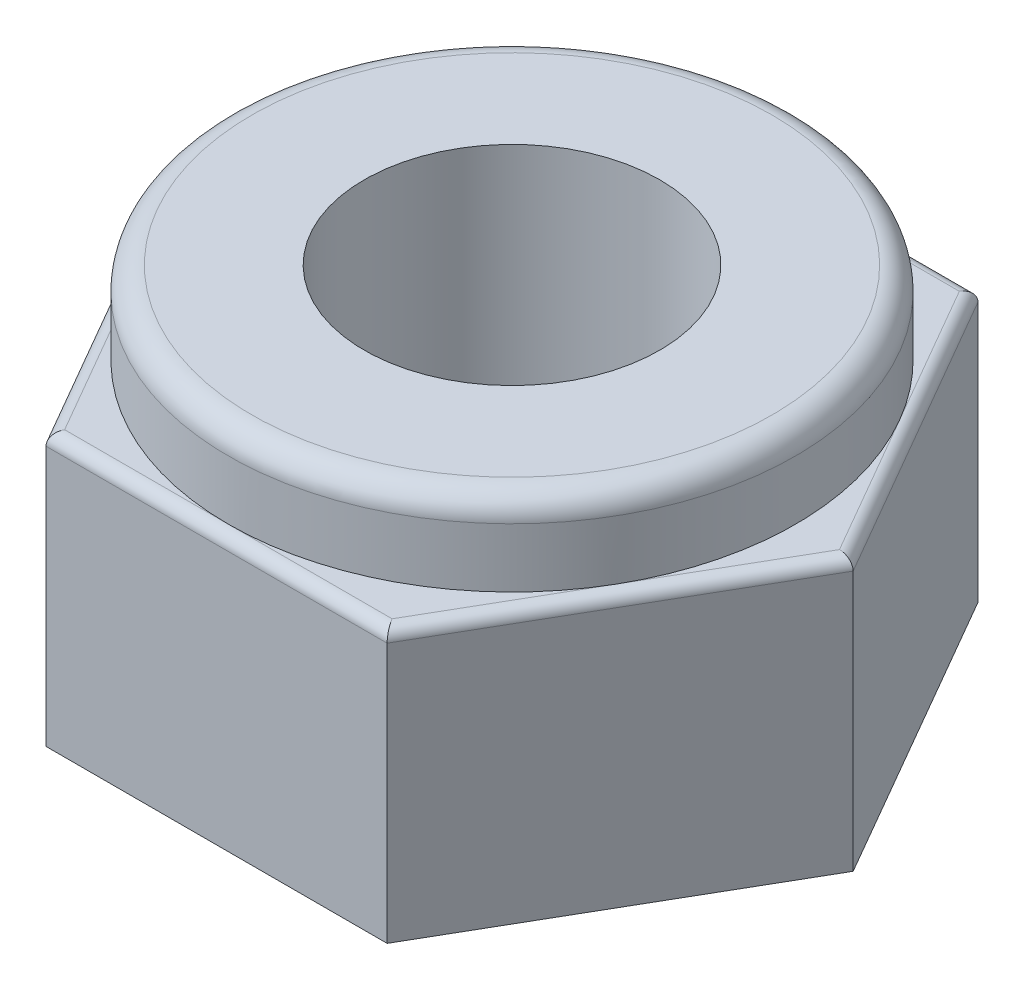
ISO-10303-21;
HEADER;
FILE_DESCRIPTION(('STEP AP214'),'2;1');
FILE_NAME('part.step','',(''),(''),'','','');
FILE_SCHEMA(('AUTOMOTIVE_DESIGN { 1 0 10303 214 1 1 1 1 }'));
ENDSEC;
DATA;
#1=APPLICATION_CONTEXT('core data for automotive mechanical design processes');
#2=APPLICATION_PROTOCOL_DEFINITION('international standard','automotive_design',2000,#1);
#3=PRODUCT_CONTEXT('',#1,'mechanical');
#4=PRODUCT('Part','Part','',(#3));
#5=PRODUCT_RELATED_PRODUCT_CATEGORY('part','',(#4));
#6=PRODUCT_DEFINITION_FORMATION('','',#4);
#7=PRODUCT_DEFINITION_CONTEXT('part definition',#1,'design');
#8=PRODUCT_DEFINITION('design','',#6,#7);
#9=PRODUCT_DEFINITION_SHAPE('','',#8);
#10=(LENGTH_UNIT() NAMED_UNIT(*) SI_UNIT(.MILLI.,.METRE.));
#11=(NAMED_UNIT(*) PLANE_ANGLE_UNIT() SI_UNIT($,.RADIAN.));
#12=(NAMED_UNIT(*) SI_UNIT($,.STERADIAN.) SOLID_ANGLE_UNIT());
#13=UNCERTAINTY_MEASURE_WITH_UNIT(LENGTH_MEASURE(1.E-05),#10,'distance_accuracy_value','');
#14=(GEOMETRIC_REPRESENTATION_CONTEXT(3) GLOBAL_UNCERTAINTY_ASSIGNED_CONTEXT((#13)) GLOBAL_UNIT_ASSIGNED_CONTEXT((#10,
#11,#12)) REPRESENTATION_CONTEXT('',''));
#15=CARTESIAN_POINT('',(0.,0.,0.));
#16=DIRECTION('',(0.,0.,1.));
#17=DIRECTION('',(1.,0.,0.));
#18=AXIS2_PLACEMENT_3D('',#15,#16,#17);
#19=CARTESIAN_POINT('',(0.,2.3,0.));
#20=DIRECTION('',(0.,1.,0.));
#21=DIRECTION('',(0.,0.,1.));
#22=AXIS2_PLACEMENT_3D('',#19,#20,#21);
#23=PLANE('',#22);
#24=CARTESIAN_POINT('',(0.,2.3,0.));
#25=DIRECTION('',(0.,1.,0.));
#26=DIRECTION('',(0.,0.,1.));
#27=AXIS2_PLACEMENT_3D('',#24,#25,#26);
#28=CIRCLE('',#27,2.4);
#29=CARTESIAN_POINT('',(0.,2.3,2.4));
#30=VERTEX_POINT('',#29);
#31=CARTESIAN_POINT('',(2.07846096908265,2.3,1.2));
#32=VERTEX_POINT('',#31);
#33=EDGE_CURVE('E150',#30,#32,#28,.T.);
#34=ORIENTED_EDGE('',*,*,#33,.F.);
#35=DIRECTION('',(1.,0.,0.));
#36=VECTOR('',#35,1.);
#37=CARTESIAN_POINT('',(1.44337567297406,2.3,2.4));
#38=LINE('',#37,#36);
#39=CARTESIAN_POINT('',(1.3856406460551,2.3,2.4));
#40=VERTEX_POINT('',#39);
#41=EDGE_CURVE('E137',#30,#40,#38,.T.);
#42=ORIENTED_EDGE('',*,*,#41,.T.);
#43=DIRECTION('',(0.5,0.,-0.866025403784439));
#44=VECTOR('',#43,1.);
#45=CARTESIAN_POINT('',(2.80014880556969,2.3,-0.0500000000000001));
#46=LINE('',#45,#44);
#47=EDGE_CURVE('E151',#40,#32,#46,.T.);
#48=ORIENTED_EDGE('',*,*,#47,.T.);
#49=EDGE_LOOP('',(#34,#42,#48));
#50=FACE_BOUND('',#49,.T.);
#51=ADVANCED_FACE('F35',(#50),#23,.T.);
#52=CARTESIAN_POINT('',(2.07846096908265,2.3,-1.2));
#53=VERTEX_POINT('',#52);
#54=EDGE_CURVE('E155',#32,#53,#28,.T.);
#55=ORIENTED_EDGE('',*,*,#54,.F.);
#56=CARTESIAN_POINT('',(2.7712812921102,2.3,0.));
#57=VERTEX_POINT('',#56);
#58=EDGE_CURVE('E136',#32,#57,#46,.T.);
#59=ORIENTED_EDGE('',*,*,#58,.T.);
#60=DIRECTION('',(-0.5,0.,-0.866025403784438));
#61=VECTOR('',#60,1.);
#62=CARTESIAN_POINT('',(1.35677313259562,2.3,-2.45));
#63=LINE('',#62,#61);
#64=EDGE_CURVE('E196',#57,#53,#63,.T.);
#65=ORIENTED_EDGE('',*,*,#64,.T.);
#66=EDGE_LOOP('',(#55,#59,#65));
#67=FACE_BOUND('',#66,.T.);
#68=ADVANCED_FACE('F251',(#67),#23,.T.);
#69=CARTESIAN_POINT('',(0.,2.3,-2.4));
#70=VERTEX_POINT('',#69);
#71=EDGE_CURVE('E51',#53,#70,#28,.T.);
#72=ORIENTED_EDGE('',*,*,#71,.F.);
#73=CARTESIAN_POINT('',(1.3856406460551,2.3,-2.4));
#74=VERTEX_POINT('',#73);
#75=EDGE_CURVE('E195',#53,#74,#63,.T.);
#76=ORIENTED_EDGE('',*,*,#75,.T.);
#77=DIRECTION('',(-1.,0.,0.));
#78=VECTOR('',#77,1.);
#79=CARTESIAN_POINT('',(-1.44337567297407,2.3,-2.4));
#80=LINE('',#79,#78);
#81=EDGE_CURVE('E200',#74,#70,#80,.T.);
#82=ORIENTED_EDGE('',*,*,#81,.T.);
#83=EDGE_LOOP('',(#72,#76,#82));
#84=FACE_BOUND('',#83,.T.);
#85=ADVANCED_FACE('F256',(#84),#23,.T.);
#86=CARTESIAN_POINT('',(-2.07846096908265,2.3,-1.2));
#87=VERTEX_POINT('',#86);
#88=EDGE_CURVE('E59',#70,#87,#28,.T.);
#89=ORIENTED_EDGE('',*,*,#88,.F.);
#90=CARTESIAN_POINT('',(-1.3856406460551,2.3,-2.4));
#91=VERTEX_POINT('',#90);
#92=EDGE_CURVE('E199',#70,#91,#80,.T.);
#93=ORIENTED_EDGE('',*,*,#92,.T.);
#94=DIRECTION('',(-0.5,0.,0.866025403784439));
#95=VECTOR('',#94,1.);
#96=CARTESIAN_POINT('',(-2.80014880556968,2.3,0.050000000000001));
#97=LINE('',#96,#95);
#98=EDGE_CURVE('E203',#91,#87,#97,.T.);
#99=ORIENTED_EDGE('',*,*,#98,.T.);
#100=EDGE_LOOP('',(#89,#93,#99));
#101=FACE_BOUND('',#100,.T.);
#102=ADVANCED_FACE('F275',(#101),#23,.T.);
#103=CARTESIAN_POINT('',(-2.07846096908265,2.3,1.2));
#104=VERTEX_POINT('',#103);
#105=EDGE_CURVE('E159',#87,#104,#28,.T.);
#106=ORIENTED_EDGE('',*,*,#105,.F.);
#107=CARTESIAN_POINT('',(-2.7712812921102,2.3,0.));
#108=VERTEX_POINT('',#107);
#109=EDGE_CURVE('E202',#87,#108,#97,.T.);
#110=ORIENTED_EDGE('',*,*,#109,.T.);
#111=DIRECTION('',(0.5,0.,0.866025403784438));
#112=VECTOR('',#111,1.);
#113=CARTESIAN_POINT('',(-1.35677313259562,2.3,2.45));
#114=LINE('',#113,#112);
#115=EDGE_CURVE('E205',#108,#104,#114,.T.);
#116=ORIENTED_EDGE('',*,*,#115,.T.);
#117=EDGE_LOOP('',(#106,#110,#116));
#118=FACE_BOUND('',#117,.T.);
#119=ADVANCED_FACE('F263',(#118),#23,.T.);
#120=CARTESIAN_POINT('',(-1.44337567297406,2.3,2.5));
#121=DIRECTION('',(0.,0.,-1.));
#122=DIRECTION('',(-1.,0.,0.));
#123=AXIS2_PLACEMENT_3D('',#120,#121,#122);
#124=PLANE('',#123);
#125=DIRECTION('',(0.,-1.,0.));
#126=VECTOR('',#125,1.);
#127=CARTESIAN_POINT('',(1.44337567297406,2.3,2.5));
#128=LINE('',#127,#126);
#129=CARTESIAN_POINT('',(1.44337567297406,2.2,2.5));
#130=VERTEX_POINT('',#129);
#131=CARTESIAN_POINT('',(1.44337567297406,0.,2.5));
#132=VERTEX_POINT('',#131);
#133=EDGE_CURVE('E148',#130,#132,#128,.T.);
#134=ORIENTED_EDGE('',*,*,#133,.F.);
#135=DIRECTION('',(1.,0.,0.));
#136=VECTOR('',#135,1.);
#137=CARTESIAN_POINT('',(-1.44337567297406,2.2,2.5));
#138=LINE('',#137,#136);
#139=CARTESIAN_POINT('',(-1.44337567297406,2.2,2.5));
#140=VERTEX_POINT('',#139);
#141=EDGE_CURVE('E219',#130,#140,#138,.F.);
#142=ORIENTED_EDGE('',*,*,#141,.T.);
#143=DIRECTION('',(0.,-1.,0.));
#144=VECTOR('',#143,1.);
#145=CARTESIAN_POINT('',(-1.44337567297406,2.3,2.5));
#146=LINE('',#145,#144);
#147=CARTESIAN_POINT('',(-1.44337567297406,0.,2.5));
#148=VERTEX_POINT('',#147);
#149=EDGE_CURVE('E183',#140,#148,#146,.T.);
#150=ORIENTED_EDGE('',*,*,#149,.T.);
#151=DIRECTION('',(1.,0.,0.));
#152=VECTOR('',#151,1.);
#153=CARTESIAN_POINT('',(-1.44337567297406,0.,2.5));
#154=LINE('',#153,#152);
#155=EDGE_CURVE('E164',#148,#132,#154,.T.);
#156=ORIENTED_EDGE('',*,*,#155,.T.);
#157=EDGE_LOOP('',(#134,#142,#150,#156));
#158=FACE_BOUND('',#157,.T.);
#159=ADVANCED_FACE('F274',(#158),#124,.F.);
#160=CARTESIAN_POINT('',(1.44337567297406,2.3,2.5));
#161=DIRECTION('',(-0.866025403784439,0.,-0.5));
#162=DIRECTION('',(-0.5,0.,0.866025403784439));
#163=AXIS2_PLACEMENT_3D('',#160,#161,#162);
#164=PLANE('',#163);
#165=DIRECTION('',(0.,-1.,0.));
#166=VECTOR('',#165,1.);
#167=CARTESIAN_POINT('',(2.88675134594813,2.3,0.));
#168=LINE('',#167,#166);
#169=CARTESIAN_POINT('',(2.88675134594813,2.2,0.));
#170=VERTEX_POINT('',#169);
#171=CARTESIAN_POINT('',(2.88675134594813,0.,0.));
#172=VERTEX_POINT('',#171);
#173=EDGE_CURVE('E191',#170,#172,#168,.T.);
#174=ORIENTED_EDGE('',*,*,#173,.F.);
#175=DIRECTION('',(0.5,0.,-0.866025403784439));
#176=VECTOR('',#175,1.);
#177=CARTESIAN_POINT('',(1.44337567297406,2.2,2.5));
#178=LINE('',#177,#176);
#179=EDGE_CURVE('E217',#170,#130,#178,.F.);
#180=ORIENTED_EDGE('',*,*,#179,.T.);
#181=ORIENTED_EDGE('',*,*,#133,.T.);
#182=DIRECTION('',(0.5,0.,-0.866025403784438));
#183=VECTOR('',#182,1.);
#184=CARTESIAN_POINT('',(1.44337567297406,0.,2.5));
#185=LINE('',#184,#183);
#186=EDGE_CURVE('E167',#132,#172,#185,.T.);
#187=ORIENTED_EDGE('',*,*,#186,.T.);
#188=EDGE_LOOP('',(#174,#180,#181,#187));
#189=FACE_BOUND('',#188,.T.);
#190=ADVANCED_FACE('F281',(#189),#164,.F.);
#191=CARTESIAN_POINT('',(2.88675134594813,2.3,0.));
#192=DIRECTION('',(-0.866025403784438,0.,0.5));
#193=DIRECTION('',(0.5,0.,0.866025403784438));
#194=AXIS2_PLACEMENT_3D('',#191,#192,#193);
#195=PLANE('',#194);
#196=DIRECTION('',(0.,-1.,0.));
#197=VECTOR('',#196,1.);
#198=CARTESIAN_POINT('',(1.44337567297406,2.3,-2.5));
#199=LINE('',#198,#197);
#200=CARTESIAN_POINT('',(1.44337567297406,2.2,-2.5));
#201=VERTEX_POINT('',#200);
#202=CARTESIAN_POINT('',(1.44337567297406,0.,-2.5));
#203=VERTEX_POINT('',#202);
#204=EDGE_CURVE('E189',#201,#203,#199,.T.);
#205=ORIENTED_EDGE('',*,*,#204,.F.);
#206=DIRECTION('',(-0.5,0.,-0.866025403784438));
#207=VECTOR('',#206,1.);
#208=CARTESIAN_POINT('',(2.88675134594813,2.2,0.));
#209=LINE('',#208,#207);
#210=EDGE_CURVE('E215',#201,#170,#209,.F.);
#211=ORIENTED_EDGE('',*,*,#210,.T.);
#212=ORIENTED_EDGE('',*,*,#173,.T.);
#213=DIRECTION('',(-0.5,0.,-0.866025403784438));
#214=VECTOR('',#213,1.);
#215=CARTESIAN_POINT('',(2.88675134594813,0.,0.));
#216=LINE('',#215,#214);
#217=EDGE_CURVE('E171',#172,#203,#216,.T.);
#218=ORIENTED_EDGE('',*,*,#217,.T.);
#219=EDGE_LOOP('',(#205,#211,#212,#218));
#220=FACE_BOUND('',#219,.T.);
#221=ADVANCED_FACE('F422',(#220),#195,.F.);
#222=CARTESIAN_POINT('',(1.44337567297406,2.3,-2.5));
#223=DIRECTION('',(0.,0.,1.));
#224=DIRECTION('',(1.,0.,0.));
#225=AXIS2_PLACEMENT_3D('',#222,#223,#224);
#226=PLANE('',#225);
#227=DIRECTION('',(0.,-1.,0.));
#228=VECTOR('',#227,1.);
#229=CARTESIAN_POINT('',(-1.44337567297407,2.3,-2.5));
#230=LINE('',#229,#228);
#231=CARTESIAN_POINT('',(-1.44337567297407,2.2,-2.5));
#232=VERTEX_POINT('',#231);
#233=CARTESIAN_POINT('',(-1.44337567297407,0.,-2.5));
#234=VERTEX_POINT('',#233);
#235=EDGE_CURVE('E187',#232,#234,#230,.T.);
#236=ORIENTED_EDGE('',*,*,#235,.F.);
#237=DIRECTION('',(-1.,0.,0.));
#238=VECTOR('',#237,1.);
#239=CARTESIAN_POINT('',(1.44337567297406,2.2,-2.5));
#240=LINE('',#239,#238);
#241=EDGE_CURVE('E213',#232,#201,#240,.F.);
#242=ORIENTED_EDGE('',*,*,#241,.T.);
#243=ORIENTED_EDGE('',*,*,#204,.T.);
#244=DIRECTION('',(-1.,0.,0.));
#245=VECTOR('',#244,1.);
#246=CARTESIAN_POINT('',(1.44337567297406,0.,-2.5));
#247=LINE('',#246,#245);
#248=EDGE_CURVE('E174',#203,#234,#247,.T.);
#249=ORIENTED_EDGE('',*,*,#248,.T.);
#250=EDGE_LOOP('',(#236,#242,#243,#249));
#251=FACE_BOUND('',#250,.T.);
#252=ADVANCED_FACE('F414',(#251),#226,.F.);
#253=CARTESIAN_POINT('',(-1.44337567297407,2.3,-2.5));
#254=DIRECTION('',(0.866025403784439,0.,0.5));
#255=DIRECTION('',(0.5,0.,-0.866025403784439));
#256=AXIS2_PLACEMENT_3D('',#253,#254,#255);
#257=PLANE('',#256);
#258=DIRECTION('',(0.,-1.,0.));
#259=VECTOR('',#258,1.);
#260=CARTESIAN_POINT('',(-2.88675134594813,2.3,0.));
#261=LINE('',#260,#259);
#262=CARTESIAN_POINT('',(-2.88675134594813,2.2,0.));
#263=VERTEX_POINT('',#262);
#264=CARTESIAN_POINT('',(-2.88675134594813,0.,0.));
#265=VERTEX_POINT('',#264);
#266=EDGE_CURVE('E185',#263,#265,#261,.T.);
#267=ORIENTED_EDGE('',*,*,#266,.F.);
#268=DIRECTION('',(-0.5,0.,0.866025403784439));
#269=VECTOR('',#268,1.);
#270=CARTESIAN_POINT('',(-1.44337567297406,2.2,-2.5));
#271=LINE('',#270,#269);
#272=EDGE_CURVE('E211',#263,#232,#271,.F.);
#273=ORIENTED_EDGE('',*,*,#272,.T.);
#274=ORIENTED_EDGE('',*,*,#235,.T.);
#275=DIRECTION('',(-0.5,0.,0.866025403784439));
#276=VECTOR('',#275,1.);
#277=CARTESIAN_POINT('',(-1.44337567297407,0.,-2.5));
#278=LINE('',#277,#276);
#279=EDGE_CURVE('E177',#234,#265,#278,.T.);
#280=ORIENTED_EDGE('',*,*,#279,.T.);
#281=EDGE_LOOP('',(#267,#273,#274,#280));
#282=FACE_BOUND('',#281,.T.);
#283=ADVANCED_FACE('F270',(#282),#257,.F.);
#284=CARTESIAN_POINT('',(-2.88675134594813,2.3,0.));
#285=DIRECTION('',(0.866025403784439,0.,-0.5));
#286=DIRECTION('',(-0.5,0.,-0.866025403784438));
#287=AXIS2_PLACEMENT_3D('',#284,#285,#286);
#288=PLANE('',#287);
#289=ORIENTED_EDGE('',*,*,#149,.F.);
#290=DIRECTION('',(0.5,0.,0.866025403784438));
#291=VECTOR('',#290,1.);
#292=CARTESIAN_POINT('',(-2.88675134594813,2.2,0.));
#293=LINE('',#292,#291);
#294=EDGE_CURVE('E208',#140,#263,#293,.F.);
#295=ORIENTED_EDGE('',*,*,#294,.T.);
#296=ORIENTED_EDGE('',*,*,#266,.T.);
#297=DIRECTION('',(0.5,0.,0.866025403784439));
#298=VECTOR('',#297,1.);
#299=CARTESIAN_POINT('',(-2.88675134594813,0.,0.));
#300=LINE('',#299,#298);
#301=EDGE_CURVE('E180',#265,#148,#300,.T.);
#302=ORIENTED_EDGE('',*,*,#301,.T.);
#303=EDGE_LOOP('',(#289,#295,#296,#302));
#304=FACE_BOUND('',#303,.T.);
#305=ADVANCED_FACE('F262',(#304),#288,.F.);
#306=EDGE_CURVE('E130',#104,#30,#28,.T.);
#307=ORIENTED_EDGE('',*,*,#306,.F.);
#308=CARTESIAN_POINT('',(-1.3856406460551,2.3,2.4));
#309=VERTEX_POINT('',#308);
#310=EDGE_CURVE('E132',#104,#309,#114,.T.);
#311=ORIENTED_EDGE('',*,*,#310,.T.);
#312=EDGE_CURVE('E126',#309,#30,#38,.T.);
#313=ORIENTED_EDGE('',*,*,#312,.T.);
#314=EDGE_LOOP('',(#307,#311,#313));
#315=FACE_BOUND('',#314,.T.);
#316=ADVANCED_FACE('F128',(#315),#23,.T.);
#317=CARTESIAN_POINT('',(0.,0.,0.));
#318=DIRECTION('',(0.,1.,0.));
#319=DIRECTION('',(0.,0.,1.));
#320=AXIS2_PLACEMENT_3D('',#317,#318,#319);
#321=PLANE('',#320);
#322=CARTESIAN_POINT('',(0.,0.,0.));
#323=DIRECTION('',(0.,-1.,0.));
#324=DIRECTION('',(0.,0.,-1.));
#325=AXIS2_PLACEMENT_3D('',#322,#323,#324);
#326=CIRCLE('',#325,1.25);
#327=CARTESIAN_POINT('',(0.,0.,-1.25));
#328=VERTEX_POINT('',#327);
#329=EDGE_CURVE('E161',#328,#328,#326,.T.);
#330=ORIENTED_EDGE('',*,*,#329,.F.);
#331=EDGE_LOOP('',(#330));
#332=FACE_BOUND('',#331,.T.);
#333=ORIENTED_EDGE('',*,*,#155,.F.);
#334=ORIENTED_EDGE('',*,*,#301,.F.);
#335=ORIENTED_EDGE('',*,*,#279,.F.);
#336=ORIENTED_EDGE('',*,*,#248,.F.);
#337=ORIENTED_EDGE('',*,*,#217,.F.);
#338=ORIENTED_EDGE('',*,*,#186,.F.);
#339=EDGE_LOOP('',(#333,#334,#335,#336,#337,#338));
#340=FACE_BOUND('',#339,.T.);
#341=ADVANCED_FACE('F261',(#332,#340),#321,.F.);
#342=CARTESIAN_POINT('',(2.07846096908265,2.2,-1.2));
#343=DIRECTION('',(0.5,0.,0.866025403784438));
#344=DIRECTION('',(0.866025403784438,0.,-0.5));
#345=AXIS2_PLACEMENT_3D('',#342,#343,#344);
#346=CYLINDRICAL_SURFACE('',#345,0.1);
#347=CARTESIAN_POINT('',(2.7712812921102,2.2,0.));
#348=DIRECTION('',(0.,0.,1.));
#349=DIRECTION('',(-1.,0.,0.));
#350=AXIS2_PLACEMENT_3D('',#347,#348,#349);
#351=ELLIPSE('',#350,0.115470053837925,0.1);
#352=EDGE_CURVE('E228',#170,#57,#351,.T.);
#353=ORIENTED_EDGE('',*,*,#352,.F.);
#354=ORIENTED_EDGE('',*,*,#210,.F.);
#355=CARTESIAN_POINT('',(1.3856406460551,2.2,-2.4));
#356=DIRECTION('',(0.866025403784439,0.,0.5));
#357=DIRECTION('',(-0.5,0.,0.866025403784439));
#358=AXIS2_PLACEMENT_3D('',#355,#356,#357);
#359=ELLIPSE('',#358,0.115470053837925,0.1);
#360=EDGE_CURVE('E168',#74,#201,#359,.F.);
#361=ORIENTED_EDGE('',*,*,#360,.F.);
#362=ORIENTED_EDGE('',*,*,#75,.F.);
#363=ORIENTED_EDGE('',*,*,#64,.F.);
#364=EDGE_LOOP('',(#353,#354,#361,#362,#363));
#365=FACE_BOUND('',#364,.T.);
#366=ADVANCED_FACE('F268',(#365),#346,.T.);
#367=CARTESIAN_POINT('',(0.,2.2,-2.4));
#368=DIRECTION('',(1.,0.,0.));
#369=DIRECTION('',(0.,0.,-1.));
#370=AXIS2_PLACEMENT_3D('',#367,#368,#369);
#371=CYLINDRICAL_SURFACE('',#370,0.1);
#372=ORIENTED_EDGE('',*,*,#360,.T.);
#373=ORIENTED_EDGE('',*,*,#241,.F.);
#374=CARTESIAN_POINT('',(-1.3856406460551,2.2,-2.4));
#375=DIRECTION('',(0.866025403784439,0.,-0.5));
#376=DIRECTION('',(0.5,0.,0.866025403784439));
#377=AXIS2_PLACEMENT_3D('',#374,#375,#376);
#378=ELLIPSE('',#377,0.115470053837925,0.1);
#379=EDGE_CURVE('E225',#91,#232,#378,.F.);
#380=ORIENTED_EDGE('',*,*,#379,.F.);
#381=ORIENTED_EDGE('',*,*,#92,.F.);
#382=ORIENTED_EDGE('',*,*,#81,.F.);
#383=EDGE_LOOP('',(#372,#373,#380,#381,#382));
#384=FACE_BOUND('',#383,.T.);
#385=ADVANCED_FACE('F303',(#384),#371,.T.);
#386=CARTESIAN_POINT('',(2.07846096908265,2.2,1.2));
#387=DIRECTION('',(-0.5,0.,0.866025403784439));
#388=DIRECTION('',(0.866025403784439,0.,0.5));
#389=AXIS2_PLACEMENT_3D('',#386,#387,#388);
#390=CYLINDRICAL_SURFACE('',#389,0.1);
#391=ORIENTED_EDGE('',*,*,#352,.T.);
#392=ORIENTED_EDGE('',*,*,#58,.F.);
#393=ORIENTED_EDGE('',*,*,#47,.F.);
#394=CARTESIAN_POINT('',(1.3856406460551,2.2,2.4));
#395=DIRECTION('',(-0.866025403784439,0.,0.5));
#396=DIRECTION('',(-0.5,0.,-0.866025403784439));
#397=AXIS2_PLACEMENT_3D('',#394,#395,#396);
#398=ELLIPSE('',#397,0.115470053837925,0.1);
#399=EDGE_CURVE('E144',#130,#40,#398,.T.);
#400=ORIENTED_EDGE('',*,*,#399,.F.);
#401=ORIENTED_EDGE('',*,*,#179,.F.);
#402=EDGE_LOOP('',(#391,#392,#393,#400,#401));
#403=FACE_BOUND('',#402,.T.);
#404=ADVANCED_FACE('F295',(#403),#390,.T.);
#405=CARTESIAN_POINT('',(-2.07846096908265,2.2,-1.2));
#406=DIRECTION('',(0.5,0.,-0.866025403784439));
#407=DIRECTION('',(-0.866025403784439,0.,-0.5));
#408=AXIS2_PLACEMENT_3D('',#405,#406,#407);
#409=CYLINDRICAL_SURFACE('',#408,0.1);
#410=ORIENTED_EDGE('',*,*,#379,.T.);
#411=ORIENTED_EDGE('',*,*,#272,.F.);
#412=CARTESIAN_POINT('',(-2.7712812921102,2.2,0.));
#413=DIRECTION('',(0.,0.,-1.));
#414=DIRECTION('',(1.,0.,0.));
#415=AXIS2_PLACEMENT_3D('',#412,#413,#414);
#416=ELLIPSE('',#415,0.115470053837925,0.1);
#417=EDGE_CURVE('E222',#108,#263,#416,.F.);
#418=ORIENTED_EDGE('',*,*,#417,.F.);
#419=ORIENTED_EDGE('',*,*,#109,.F.);
#420=ORIENTED_EDGE('',*,*,#98,.F.);
#421=EDGE_LOOP('',(#410,#411,#418,#419,#420));
#422=FACE_BOUND('',#421,.T.);
#423=ADVANCED_FACE('F289',(#422),#409,.T.);
#424=CARTESIAN_POINT('',(0.,2.2,2.4));
#425=DIRECTION('',(-1.,0.,0.));
#426=DIRECTION('',(0.,0.,1.));
#427=AXIS2_PLACEMENT_3D('',#424,#425,#426);
#428=CYLINDRICAL_SURFACE('',#427,0.1);
#429=ORIENTED_EDGE('',*,*,#399,.T.);
#430=ORIENTED_EDGE('',*,*,#41,.F.);
#431=ORIENTED_EDGE('',*,*,#312,.F.);
#432=CARTESIAN_POINT('',(-1.3856406460551,2.2,2.4));
#433=DIRECTION('',(-0.866025403784439,0.,-0.5));
#434=DIRECTION('',(-0.5,0.,0.866025403784439));
#435=AXIS2_PLACEMENT_3D('',#432,#433,#434);
#436=ELLIPSE('',#435,0.115470053837925,0.1);
#437=EDGE_CURVE('E154',#140,#309,#436,.T.);
#438=ORIENTED_EDGE('',*,*,#437,.F.);
#439=ORIENTED_EDGE('',*,*,#141,.F.);
#440=EDGE_LOOP('',(#429,#430,#431,#438,#439));
#441=FACE_BOUND('',#440,.T.);
#442=ADVANCED_FACE('F141',(#441),#428,.T.);
#443=CARTESIAN_POINT('',(-2.07846096908265,2.2,1.2));
#444=DIRECTION('',(-0.5,0.,-0.866025403784438));
#445=DIRECTION('',(-0.866025403784439,0.,0.5));
#446=AXIS2_PLACEMENT_3D('',#443,#444,#445);
#447=CYLINDRICAL_SURFACE('',#446,0.1);
#448=ORIENTED_EDGE('',*,*,#417,.T.);
#449=ORIENTED_EDGE('',*,*,#294,.F.);
#450=ORIENTED_EDGE('',*,*,#437,.T.);
#451=ORIENTED_EDGE('',*,*,#310,.F.);
#452=ORIENTED_EDGE('',*,*,#115,.F.);
#453=EDGE_LOOP('',(#448,#449,#450,#451,#452));
#454=FACE_BOUND('',#453,.T.);
#455=ADVANCED_FACE('F319',(#454),#447,.T.);
#456=CARTESIAN_POINT('',(0.,3.,0.));
#457=DIRECTION('',(0.,-1.,0.));
#458=DIRECTION('',(0.,0.,-1.));
#459=AXIS2_PLACEMENT_3D('',#456,#457,#458);
#460=CYLINDRICAL_SURFACE('',#459,2.4);
#461=CARTESIAN_POINT('',(0.,2.8,0.));
#462=DIRECTION('',(0.,-1.,0.));
#463=DIRECTION('',(0.,0.,-1.));
#464=AXIS2_PLACEMENT_3D('',#461,#462,#463);
#465=CIRCLE('',#464,2.4);
#466=CARTESIAN_POINT('',(0.,2.8,-2.4));
#467=VERTEX_POINT('',#466);
#468=EDGE_CURVE('E44',#467,#467,#465,.T.);
#469=ORIENTED_EDGE('',*,*,#468,.T.);
#470=EDGE_LOOP('',(#469));
#471=FACE_BOUND('',#470,.T.);
#472=ORIENTED_EDGE('',*,*,#306,.T.);
#473=ORIENTED_EDGE('',*,*,#33,.T.);
#474=ORIENTED_EDGE('',*,*,#54,.T.);
#475=ORIENTED_EDGE('',*,*,#71,.T.);
#476=ORIENTED_EDGE('',*,*,#88,.T.);
#477=ORIENTED_EDGE('',*,*,#105,.T.);
#478=EDGE_LOOP('',(#472,#473,#474,#475,#476,#477));
#479=FACE_BOUND('',#478,.T.);
#480=ADVANCED_FACE('F158',(#471,#479),#460,.T.);
#481=CARTESIAN_POINT('',(0.,3.,0.));
#482=DIRECTION('',(0.,-1.,0.));
#483=DIRECTION('',(0.,0.,-1.));
#484=AXIS2_PLACEMENT_3D('',#481,#482,#483);
#485=PLANE('',#484);
#486=CARTESIAN_POINT('',(0.,3.,0.));
#487=DIRECTION('',(0.,-1.,0.));
#488=DIRECTION('',(0.,0.,-1.));
#489=AXIS2_PLACEMENT_3D('',#486,#487,#488);
#490=CIRCLE('',#489,1.25);
#491=CARTESIAN_POINT('',(0.,3.,-1.25));
#492=VERTEX_POINT('',#491);
#493=EDGE_CURVE('E39',#492,#492,#490,.T.);
#494=ORIENTED_EDGE('',*,*,#493,.T.);
#495=EDGE_LOOP('',(#494));
#496=FACE_BOUND('',#495,.T.);
#497=CARTESIAN_POINT('',(0.,3.,0.));
#498=DIRECTION('',(0.,-1.,0.));
#499=DIRECTION('',(0.,0.,-1.));
#500=AXIS2_PLACEMENT_3D('',#497,#498,#499);
#501=CIRCLE('',#500,2.2);
#502=CARTESIAN_POINT('',(0.,3.,-2.2));
#503=VERTEX_POINT('',#502);
#504=EDGE_CURVE('E11',#503,#503,#501,.F.);
#505=ORIENTED_EDGE('',*,*,#504,.T.);
#506=EDGE_LOOP('',(#505));
#507=FACE_BOUND('',#506,.T.);
#508=ADVANCED_FACE('F239',(#496,#507),#485,.F.);
#509=CARTESIAN_POINT('',(0.,2.8,0.));
#510=DIRECTION('',(0.,-1.,0.));
#511=DIRECTION('',(0.,0.,-1.));
#512=AXIS2_PLACEMENT_3D('',#509,#510,#511);
#513=TOROIDAL_SURFACE('',#512,2.2,0.2);
#514=ORIENTED_EDGE('',*,*,#504,.F.);
#515=EDGE_LOOP('',(#514));
#516=FACE_BOUND('',#515,.T.);
#517=ORIENTED_EDGE('',*,*,#468,.F.);
#518=EDGE_LOOP('',(#517));
#519=FACE_BOUND('',#518,.T.);
#520=ADVANCED_FACE('F37',(#516,#519),#513,.T.);
#521=CARTESIAN_POINT('',(0.,12.8,0.));
#522=DIRECTION('',(0.,-1.,0.));
#523=DIRECTION('',(0.,0.,-1.));
#524=AXIS2_PLACEMENT_3D('',#521,#522,#523);
#525=CYLINDRICAL_SURFACE('',#524,1.25);
#526=ORIENTED_EDGE('',*,*,#329,.T.);
#527=EDGE_LOOP('',(#526));
#528=FACE_BOUND('',#527,.T.);
#529=ORIENTED_EDGE('',*,*,#493,.F.);
#530=EDGE_LOOP('',(#529));
#531=FACE_BOUND('',#530,.T.);
#532=ADVANCED_FACE('F238',(#528,#531),#525,.F.);
#533=CLOSED_SHELL('',(#51,#68,#85,#102,#119,#159,#190,#221,#252,#283,#305,#316,#341,#366,#385,
#404,#423,#442,#455,#480,#508,#520,#532));
#534=MANIFOLD_SOLID_BREP('B2',#533);
#535=ADVANCED_BREP_SHAPE_REPRESENTATION('',(#18,#534),#14);
#536=SHAPE_DEFINITION_REPRESENTATION(#9,#535);
ENDSEC;
END-ISO-10303-21;
